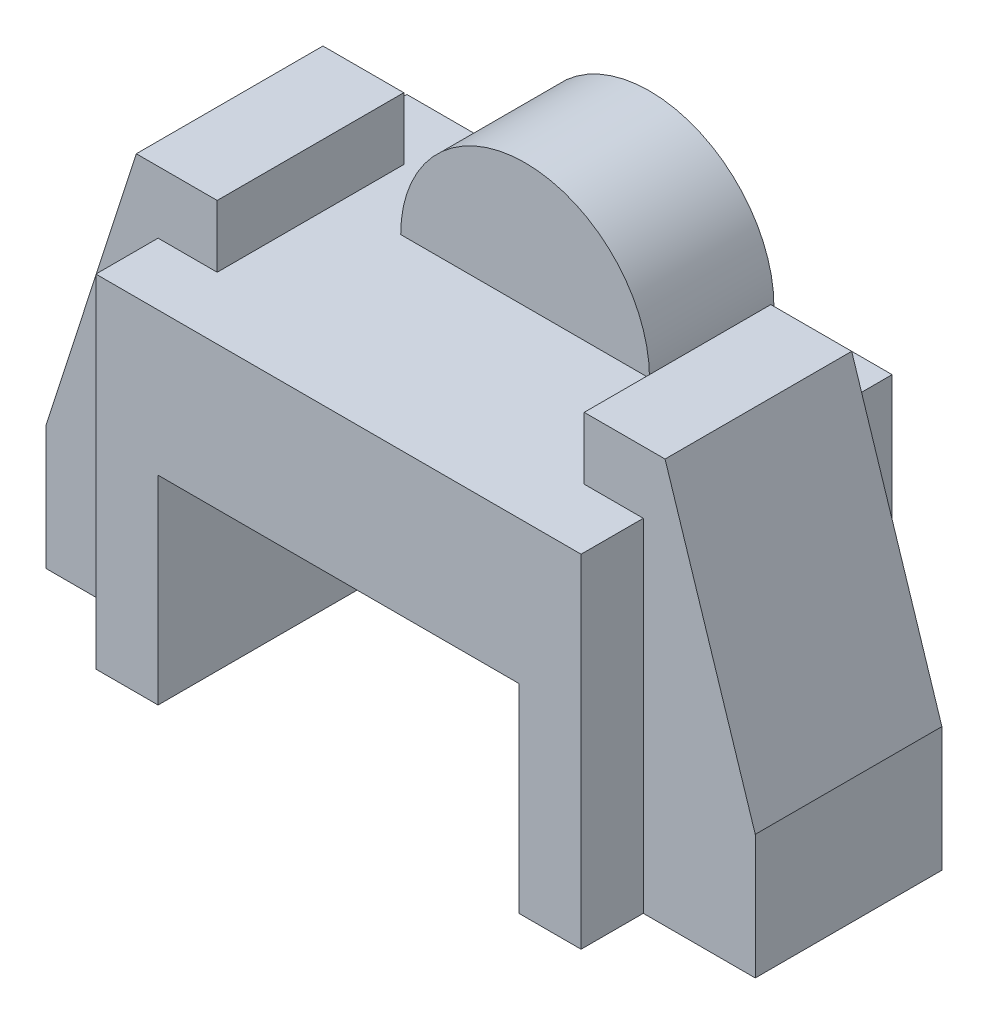
ISO-10303-21;
HEADER;
FILE_DESCRIPTION(('STEP AP214'),'2;1');
FILE_NAME('part.step','',(''),(''),'','','');
FILE_SCHEMA(('AUTOMOTIVE_DESIGN { 1 0 10303 214 1 1 1 1 }'));
ENDSEC;
DATA;
#1=APPLICATION_CONTEXT('core data for automotive mechanical design processes');
#2=APPLICATION_PROTOCOL_DEFINITION('international standard','automotive_design',2000,#1);
#3=PRODUCT_CONTEXT('',#1,'mechanical');
#4=PRODUCT('Part','Part','',(#3));
#5=PRODUCT_RELATED_PRODUCT_CATEGORY('part','',(#4));
#6=PRODUCT_DEFINITION_FORMATION('','',#4);
#7=PRODUCT_DEFINITION_CONTEXT('part definition',#1,'design');
#8=PRODUCT_DEFINITION('design','',#6,#7);
#9=PRODUCT_DEFINITION_SHAPE('','',#8);
#10=(LENGTH_UNIT() NAMED_UNIT(*) SI_UNIT(.MILLI.,.METRE.));
#11=(NAMED_UNIT(*) PLANE_ANGLE_UNIT() SI_UNIT($,.RADIAN.));
#12=(NAMED_UNIT(*) SI_UNIT($,.STERADIAN.) SOLID_ANGLE_UNIT());
#13=UNCERTAINTY_MEASURE_WITH_UNIT(LENGTH_MEASURE(1.E-05),#10,'distance_accuracy_value','');
#14=(GEOMETRIC_REPRESENTATION_CONTEXT(3) GLOBAL_UNCERTAINTY_ASSIGNED_CONTEXT((#13)) GLOBAL_UNIT_ASSIGNED_CONTEXT((#10,
#11,#12)) REPRESENTATION_CONTEXT('',''));
#15=CARTESIAN_POINT('',(0.,0.,0.));
#16=DIRECTION('',(0.,0.,1.));
#17=DIRECTION('',(1.,0.,0.));
#18=AXIS2_PLACEMENT_3D('',#15,#16,#17);
#19=CARTESIAN_POINT('',(0.,55.,50.));
#20=DIRECTION('',(0.,-1.,0.));
#21=DIRECTION('',(0.,0.,-1.));
#22=AXIS2_PLACEMENT_3D('',#19,#20,#21);
#23=PLANE('',#22);
#24=DIRECTION('',(-1.,0.,0.));
#25=VECTOR('',#24,1.);
#26=CARTESIAN_POINT('',(0.,55.,10.));
#27=LINE('',#26,#25);
#28=CARTESIAN_POINT('',(78.,55.,10.));
#29=VERTEX_POINT('',#28);
#30=CARTESIAN_POINT('',(68.5,55.,10.));
#31=VERTEX_POINT('',#30);
#32=EDGE_CURVE('E214',#29,#31,#27,.T.);
#33=ORIENTED_EDGE('',*,*,#32,.F.);
#34=DIRECTION('',(0.,0.,-1.));
#35=VECTOR('',#34,1.);
#36=CARTESIAN_POINT('',(78.,55.,50.));
#37=LINE('',#36,#35);
#38=CARTESIAN_POINT('',(78.,55.,0.));
#39=VERTEX_POINT('',#38);
#40=EDGE_CURVE('E349',#29,#39,#37,.T.);
#41=ORIENTED_EDGE('',*,*,#40,.T.);
#42=DIRECTION('',(-1.,0.,0.));
#43=VECTOR('',#42,1.);
#44=CARTESIAN_POINT('',(0.,55.,0.));
#45=LINE('',#44,#43);
#46=CARTESIAN_POINT('',(59.,55.,0.));
#47=VERTEX_POINT('',#46);
#48=EDGE_CURVE('E326',#39,#47,#45,.T.);
#49=ORIENTED_EDGE('',*,*,#48,.T.);
#50=DIRECTION('',(0.,0.,-1.));
#51=VECTOR('',#50,1.);
#52=CARTESIAN_POINT('',(59.,55.,20.));
#53=LINE('',#52,#51);
#54=CARTESIAN_POINT('',(59.,55.,20.));
#55=VERTEX_POINT('',#54);
#56=EDGE_CURVE('E288',#47,#55,#53,.F.);
#57=ORIENTED_EDGE('',*,*,#56,.T.);
#58=DIRECTION('',(1.,0.,0.));
#59=VECTOR('',#58,1.);
#60=CARTESIAN_POINT('',(0.,55.,20.));
#61=LINE('',#60,#59);
#62=CARTESIAN_POINT('',(19.,55.,20.));
#63=VERTEX_POINT('',#62);
#64=EDGE_CURVE('E361',#63,#55,#61,.T.);
#65=ORIENTED_EDGE('',*,*,#64,.F.);
#66=DIRECTION('',(0.,0.,-1.));
#67=VECTOR('',#66,1.);
#68=CARTESIAN_POINT('',(19.,55.,20.));
#69=LINE('',#68,#67);
#70=CARTESIAN_POINT('',(19.,55.,0.));
#71=VERTEX_POINT('',#70);
#72=EDGE_CURVE('E292',#63,#71,#69,.T.);
#73=ORIENTED_EDGE('',*,*,#72,.T.);
#74=CARTESIAN_POINT('',(0.,55.,0.));
#75=VERTEX_POINT('',#74);
#76=EDGE_CURVE('E344',#71,#75,#45,.T.);
#77=ORIENTED_EDGE('',*,*,#76,.T.);
#78=DIRECTION('',(0.,0.,-1.));
#79=VECTOR('',#78,1.);
#80=CARTESIAN_POINT('',(0.,55.,50.));
#81=LINE('',#80,#79);
#82=CARTESIAN_POINT('',(0.,55.,10.));
#83=VERTEX_POINT('',#82);
#84=EDGE_CURVE('E334',#83,#75,#81,.T.);
#85=ORIENTED_EDGE('',*,*,#84,.F.);
#86=DIRECTION('',(-1.,0.,0.));
#87=VECTOR('',#86,1.);
#88=CARTESIAN_POINT('',(0.,55.,10.));
#89=LINE('',#88,#87);
#90=CARTESIAN_POINT('',(9.49999999999997,55.,10.));
#91=VERTEX_POINT('',#90);
#92=EDGE_CURVE('E368',#91,#83,#89,.T.);
#93=ORIENTED_EDGE('',*,*,#92,.F.);
#94=DIRECTION('',(0.,0.,-1.));
#95=VECTOR('',#94,1.);
#96=CARTESIAN_POINT('',(9.49999999999997,55.,50.));
#97=LINE('',#96,#95);
#98=CARTESIAN_POINT('',(9.49999999999997,55.,40.));
#99=VERTEX_POINT('',#98);
#100=EDGE_CURVE('E366',#99,#91,#97,.T.);
#101=ORIENTED_EDGE('',*,*,#100,.F.);
#102=DIRECTION('',(-1.,0.,0.));
#103=VECTOR('',#102,1.);
#104=CARTESIAN_POINT('',(0.,55.,40.));
#105=LINE('',#104,#103);
#106=CARTESIAN_POINT('',(0.,55.,40.));
#107=VERTEX_POINT('',#106);
#108=EDGE_CURVE('E364',#99,#107,#105,.T.);
#109=ORIENTED_EDGE('',*,*,#108,.T.);
#110=CARTESIAN_POINT('',(0.,55.,50.));
#111=VERTEX_POINT('',#110);
#112=EDGE_CURVE('E346',#111,#107,#81,.T.);
#113=ORIENTED_EDGE('',*,*,#112,.F.);
#114=DIRECTION('',(-1.,0.,0.));
#115=VECTOR('',#114,1.);
#116=CARTESIAN_POINT('',(0.,55.,50.));
#117=LINE('',#116,#115);
#118=CARTESIAN_POINT('',(78.,55.,50.));
#119=VERTEX_POINT('',#118);
#120=EDGE_CURVE('E332',#119,#111,#117,.T.);
#121=ORIENTED_EDGE('',*,*,#120,.F.);
#122=CARTESIAN_POINT('',(78.,55.,40.));
#123=VERTEX_POINT('',#122);
#124=EDGE_CURVE('E350',#119,#123,#37,.T.);
#125=ORIENTED_EDGE('',*,*,#124,.T.);
#126=DIRECTION('',(-1.,0.,0.));
#127=VECTOR('',#126,1.);
#128=CARTESIAN_POINT('',(0.,55.,40.));
#129=LINE('',#128,#127);
#130=CARTESIAN_POINT('',(68.5,55.,40.));
#131=VERTEX_POINT('',#130);
#132=EDGE_CURVE('E49',#123,#131,#129,.T.);
#133=ORIENTED_EDGE('',*,*,#132,.T.);
#134=DIRECTION('',(0.,0.,-1.));
#135=VECTOR('',#134,1.);
#136=CARTESIAN_POINT('',(68.5,55.,50.));
#137=LINE('',#136,#135);
#138=EDGE_CURVE('E245',#131,#31,#137,.T.);
#139=ORIENTED_EDGE('',*,*,#138,.T.);
#140=EDGE_LOOP('',(#33,#41,#49,#57,#65,#73,#77,#85,#93,#101,#109,#113,#121,#125,#133,#139));
#141=FACE_BOUND('',#140,.T.);
#142=ADVANCED_FACE('F34',(#141),#23,.F.);
#143=CARTESIAN_POINT('',(78.,0.,50.));
#144=DIRECTION('',(-1.,0.,0.));
#145=DIRECTION('',(0.,0.,1.));
#146=AXIS2_PLACEMENT_3D('',#143,#144,#145);
#147=PLANE('',#146);
#148=DIRECTION('',(0.,1.,0.));
#149=VECTOR('',#148,1.);
#150=CARTESIAN_POINT('',(78.,0.,10.));
#151=LINE('',#150,#149);
#152=CARTESIAN_POINT('',(78.,0.,10.));
#153=VERTEX_POINT('',#152);
#154=EDGE_CURVE('E11',#153,#29,#151,.T.);
#155=ORIENTED_EDGE('',*,*,#154,.F.);
#156=DIRECTION('',(0.,0.,-1.));
#157=VECTOR('',#156,1.);
#158=CARTESIAN_POINT('',(78.,0.,50.));
#159=LINE('',#158,#157);
#160=CARTESIAN_POINT('',(78.,0.,0.));
#161=VERTEX_POINT('',#160);
#162=EDGE_CURVE('E353',#153,#161,#159,.T.);
#163=ORIENTED_EDGE('',*,*,#162,.T.);
#164=DIRECTION('',(0.,1.,0.));
#165=VECTOR('',#164,1.);
#166=CARTESIAN_POINT('',(78.,0.,0.));
#167=LINE('',#166,#165);
#168=EDGE_CURVE('E341',#161,#39,#167,.T.);
#169=ORIENTED_EDGE('',*,*,#168,.T.);
#170=ORIENTED_EDGE('',*,*,#40,.F.);
#171=EDGE_LOOP('',(#155,#163,#169,#170));
#172=FACE_BOUND('',#171,.T.);
#173=ADVANCED_FACE('F401',(#172),#147,.F.);
#174=CARTESIAN_POINT('',(0.,0.,50.));
#175=DIRECTION('',(1.,0.,0.));
#176=DIRECTION('',(0.,0.,-1.));
#177=AXIS2_PLACEMENT_3D('',#174,#175,#176);
#178=PLANE('',#177);
#179=DIRECTION('',(0.,-1.,0.));
#180=VECTOR('',#179,1.);
#181=CARTESIAN_POINT('',(0.,0.,10.));
#182=LINE('',#181,#180);
#183=CARTESIAN_POINT('',(0.,0.,10.));
#184=VERTEX_POINT('',#183);
#185=EDGE_CURVE('E282',#83,#184,#182,.T.);
#186=ORIENTED_EDGE('',*,*,#185,.F.);
#187=ORIENTED_EDGE('',*,*,#84,.T.);
#188=DIRECTION('',(0.,-1.,0.));
#189=VECTOR('',#188,1.);
#190=CARTESIAN_POINT('',(0.,0.,0.));
#191=LINE('',#190,#189);
#192=CARTESIAN_POINT('',(0.,0.,0.));
#193=VERTEX_POINT('',#192);
#194=EDGE_CURVE('E315',#75,#193,#191,.T.);
#195=ORIENTED_EDGE('',*,*,#194,.T.);
#196=DIRECTION('',(0.,0.,-1.));
#197=VECTOR('',#196,1.);
#198=CARTESIAN_POINT('',(0.,0.,50.));
#199=LINE('',#198,#197);
#200=EDGE_CURVE('E357',#184,#193,#199,.T.);
#201=ORIENTED_EDGE('',*,*,#200,.F.);
#202=EDGE_LOOP('',(#186,#187,#195,#201));
#203=FACE_BOUND('',#202,.T.);
#204=ADVANCED_FACE('F424',(#203),#178,.F.);
#205=CARTESIAN_POINT('',(0.,0.,50.));
#206=DIRECTION('',(0.,1.,0.));
#207=DIRECTION('',(0.,0.,1.));
#208=AXIS2_PLACEMENT_3D('',#205,#206,#207);
#209=PLANE('',#208);
#210=DIRECTION('',(-1.,0.,0.));
#211=VECTOR('',#210,1.);
#212=CARTESIAN_POINT('',(9.49999999999997,0.,10.));
#213=LINE('',#212,#211);
#214=CARTESIAN_POINT('',(-18.,0.,10.));
#215=VERTEX_POINT('',#214);
#216=EDGE_CURVE('E251',#184,#215,#213,.T.);
#217=ORIENTED_EDGE('',*,*,#216,.F.);
#218=ORIENTED_EDGE('',*,*,#200,.T.);
#219=DIRECTION('',(1.,0.,0.));
#220=VECTOR('',#219,1.);
#221=CARTESIAN_POINT('',(0.,0.,0.));
#222=LINE('',#221,#220);
#223=CARTESIAN_POINT('',(10.,0.,0.));
#224=VERTEX_POINT('',#223);
#225=EDGE_CURVE('E338',#193,#224,#222,.T.);
#226=ORIENTED_EDGE('',*,*,#225,.T.);
#227=DIRECTION('',(0.,0.,1.));
#228=VECTOR('',#227,1.);
#229=CARTESIAN_POINT('',(10.,0.,0.));
#230=LINE('',#229,#228);
#231=CARTESIAN_POINT('',(10.,0.,50.));
#232=VERTEX_POINT('',#231);
#233=EDGE_CURVE('E306',#224,#232,#230,.T.);
#234=ORIENTED_EDGE('',*,*,#233,.T.);
#235=DIRECTION('',(1.,0.,0.));
#236=VECTOR('',#235,1.);
#237=CARTESIAN_POINT('',(0.,0.,50.));
#238=LINE('',#237,#236);
#239=CARTESIAN_POINT('',(0.,0.,50.));
#240=VERTEX_POINT('',#239);
#241=EDGE_CURVE('E327',#240,#232,#238,.T.);
#242=ORIENTED_EDGE('',*,*,#241,.F.);
#243=CARTESIAN_POINT('',(0.,0.,40.));
#244=VERTEX_POINT('',#243);
#245=EDGE_CURVE('E358',#240,#244,#199,.T.);
#246=ORIENTED_EDGE('',*,*,#245,.T.);
#247=DIRECTION('',(-1.,0.,0.));
#248=VECTOR('',#247,1.);
#249=CARTESIAN_POINT('',(9.49999999999997,0.,40.));
#250=LINE('',#249,#248);
#251=CARTESIAN_POINT('',(-18.,0.,40.));
#252=VERTEX_POINT('',#251);
#253=EDGE_CURVE('E263',#244,#252,#250,.T.);
#254=ORIENTED_EDGE('',*,*,#253,.T.);
#255=DIRECTION('',(0.,0.,1.));
#256=VECTOR('',#255,1.);
#257=CARTESIAN_POINT('',(-18.,0.,10.));
#258=LINE('',#257,#256);
#259=EDGE_CURVE('E278',#215,#252,#258,.T.);
#260=ORIENTED_EDGE('',*,*,#259,.F.);
#261=EDGE_LOOP('',(#217,#218,#226,#234,#242,#246,#254,#260));
#262=FACE_BOUND('',#261,.T.);
#263=ADVANCED_FACE('F430',(#262),#209,.F.);
#264=ORIENTED_EDGE('',*,*,#112,.T.);
#265=DIRECTION('',(0.,-1.,0.));
#266=VECTOR('',#265,1.);
#267=CARTESIAN_POINT('',(0.,0.,40.));
#268=LINE('',#267,#266);
#269=EDGE_CURVE('E57',#107,#244,#268,.T.);
#270=ORIENTED_EDGE('',*,*,#269,.T.);
#271=ORIENTED_EDGE('',*,*,#245,.F.);
#272=DIRECTION('',(0.,-1.,0.));
#273=VECTOR('',#272,1.);
#274=CARTESIAN_POINT('',(0.,0.,50.));
#275=LINE('',#274,#273);
#276=EDGE_CURVE('E322',#111,#240,#275,.T.);
#277=ORIENTED_EDGE('',*,*,#276,.F.);
#278=EDGE_LOOP('',(#264,#270,#271,#277));
#279=FACE_BOUND('',#278,.T.);
#280=ADVANCED_FACE('F36',(#279),#178,.F.);
#281=ORIENTED_EDGE('',*,*,#162,.F.);
#282=DIRECTION('',(1.,0.,0.));
#283=VECTOR('',#282,1.);
#284=CARTESIAN_POINT('',(68.5,0.,10.));
#285=LINE('',#284,#283);
#286=CARTESIAN_POINT('',(96.,0.,10.));
#287=VERTEX_POINT('',#286);
#288=EDGE_CURVE('E225',#153,#287,#285,.T.);
#289=ORIENTED_EDGE('',*,*,#288,.T.);
#290=DIRECTION('',(0.,0.,1.));
#291=VECTOR('',#290,1.);
#292=CARTESIAN_POINT('',(96.,0.,10.));
#293=LINE('',#292,#291);
#294=CARTESIAN_POINT('',(96.,0.,40.));
#295=VERTEX_POINT('',#294);
#296=EDGE_CURVE('E227',#287,#295,#293,.T.);
#297=ORIENTED_EDGE('',*,*,#296,.T.);
#298=DIRECTION('',(1.,0.,0.));
#299=VECTOR('',#298,1.);
#300=CARTESIAN_POINT('',(68.5,0.,40.));
#301=LINE('',#300,#299);
#302=CARTESIAN_POINT('',(78.,0.,40.));
#303=VERTEX_POINT('',#302);
#304=EDGE_CURVE('E215',#303,#295,#301,.T.);
#305=ORIENTED_EDGE('',*,*,#304,.F.);
#306=CARTESIAN_POINT('',(78.,0.,50.));
#307=VERTEX_POINT('',#306);
#308=EDGE_CURVE('E354',#307,#303,#159,.T.);
#309=ORIENTED_EDGE('',*,*,#308,.F.);
#310=CARTESIAN_POINT('',(68.,0.,50.));
#311=VERTEX_POINT('',#310);
#312=EDGE_CURVE('E325',#311,#307,#238,.T.);
#313=ORIENTED_EDGE('',*,*,#312,.F.);
#314=DIRECTION('',(0.,0.,1.));
#315=VECTOR('',#314,1.);
#316=CARTESIAN_POINT('',(68.,0.,0.));
#317=LINE('',#316,#315);
#318=CARTESIAN_POINT('',(68.,0.,0.));
#319=VERTEX_POINT('',#318);
#320=EDGE_CURVE('E318',#319,#311,#317,.T.);
#321=ORIENTED_EDGE('',*,*,#320,.F.);
#322=EDGE_CURVE('E337',#319,#161,#222,.T.);
#323=ORIENTED_EDGE('',*,*,#322,.T.);
#324=EDGE_LOOP('',(#281,#289,#297,#305,#309,#313,#321,#323));
#325=FACE_BOUND('',#324,.T.);
#326=ADVANCED_FACE('F388',(#325),#209,.F.);
#327=ORIENTED_EDGE('',*,*,#308,.T.);
#328=DIRECTION('',(0.,1.,0.));
#329=VECTOR('',#328,1.);
#330=CARTESIAN_POINT('',(78.,0.,40.));
#331=LINE('',#330,#329);
#332=EDGE_CURVE('E42',#303,#123,#331,.T.);
#333=ORIENTED_EDGE('',*,*,#332,.T.);
#334=ORIENTED_EDGE('',*,*,#124,.F.);
#335=DIRECTION('',(0.,1.,0.));
#336=VECTOR('',#335,1.);
#337=CARTESIAN_POINT('',(78.,0.,50.));
#338=LINE('',#337,#336);
#339=EDGE_CURVE('E330',#307,#119,#338,.T.);
#340=ORIENTED_EDGE('',*,*,#339,.F.);
#341=EDGE_LOOP('',(#327,#333,#334,#340));
#342=FACE_BOUND('',#341,.T.);
#343=ADVANCED_FACE('F371',(#342),#147,.F.);
#344=CARTESIAN_POINT('',(0.,0.,50.));
#345=DIRECTION('',(0.,0.,-1.));
#346=DIRECTION('',(-1.,0.,0.));
#347=AXIS2_PLACEMENT_3D('',#344,#345,#346);
#348=PLANE('',#347);
#349=ORIENTED_EDGE('',*,*,#241,.T.);
#350=DIRECTION('',(0.,-1.,0.));
#351=VECTOR('',#350,1.);
#352=CARTESIAN_POINT('',(10.,0.,50.));
#353=LINE('',#352,#351);
#354=CARTESIAN_POINT('',(10.,32.,50.));
#355=VERTEX_POINT('',#354);
#356=EDGE_CURVE('E295',#355,#232,#353,.T.);
#357=ORIENTED_EDGE('',*,*,#356,.F.);
#358=DIRECTION('',(-1.,0.,0.));
#359=VECTOR('',#358,1.);
#360=CARTESIAN_POINT('',(10.,32.,50.));
#361=LINE('',#360,#359);
#362=CARTESIAN_POINT('',(68.,32.,50.));
#363=VERTEX_POINT('',#362);
#364=EDGE_CURVE('E300',#363,#355,#361,.T.);
#365=ORIENTED_EDGE('',*,*,#364,.F.);
#366=DIRECTION('',(0.,1.,0.));
#367=VECTOR('',#366,1.);
#368=CARTESIAN_POINT('',(68.,0.,50.));
#369=LINE('',#368,#367);
#370=EDGE_CURVE('E308',#311,#363,#369,.T.);
#371=ORIENTED_EDGE('',*,*,#370,.F.);
#372=ORIENTED_EDGE('',*,*,#312,.T.);
#373=ORIENTED_EDGE('',*,*,#339,.T.);
#374=ORIENTED_EDGE('',*,*,#120,.T.);
#375=ORIENTED_EDGE('',*,*,#276,.T.);
#376=EDGE_LOOP('',(#349,#357,#365,#371,#372,#373,#374,#375));
#377=FACE_BOUND('',#376,.T.);
#378=ADVANCED_FACE('F380',(#377),#348,.F.);
#379=CARTESIAN_POINT('',(0.,0.,0.));
#380=DIRECTION('',(0.,0.,-1.));
#381=DIRECTION('',(-1.,0.,0.));
#382=AXIS2_PLACEMENT_3D('',#379,#380,#381);
#383=PLANE('',#382);
#384=ORIENTED_EDGE('',*,*,#76,.F.);
#385=CARTESIAN_POINT('',(39.,55.,0.));
#386=DIRECTION('',(0.,0.,-1.));
#387=DIRECTION('',(-1.,0.,0.));
#388=AXIS2_PLACEMENT_3D('',#385,#386,#387);
#389=CIRCLE('',#388,20.);
#390=EDGE_CURVE('E284',#71,#47,#389,.T.);
#391=ORIENTED_EDGE('',*,*,#390,.T.);
#392=ORIENTED_EDGE('',*,*,#48,.F.);
#393=ORIENTED_EDGE('',*,*,#168,.F.);
#394=ORIENTED_EDGE('',*,*,#322,.F.);
#395=DIRECTION('',(0.,1.,0.));
#396=VECTOR('',#395,1.);
#397=CARTESIAN_POINT('',(68.,0.,0.));
#398=LINE('',#397,#396);
#399=CARTESIAN_POINT('',(68.,32.,0.));
#400=VERTEX_POINT('',#399);
#401=EDGE_CURVE('E299',#319,#400,#398,.T.);
#402=ORIENTED_EDGE('',*,*,#401,.T.);
#403=DIRECTION('',(-1.,0.,0.));
#404=VECTOR('',#403,1.);
#405=CARTESIAN_POINT('',(10.,32.,0.));
#406=LINE('',#405,#404);
#407=CARTESIAN_POINT('',(10.,32.,0.));
#408=VERTEX_POINT('',#407);
#409=EDGE_CURVE('E303',#400,#408,#406,.T.);
#410=ORIENTED_EDGE('',*,*,#409,.T.);
#411=DIRECTION('',(0.,-1.,0.));
#412=VECTOR('',#411,1.);
#413=CARTESIAN_POINT('',(10.,0.,0.));
#414=LINE('',#413,#412);
#415=EDGE_CURVE('E296',#408,#224,#414,.T.);
#416=ORIENTED_EDGE('',*,*,#415,.T.);
#417=ORIENTED_EDGE('',*,*,#225,.F.);
#418=ORIENTED_EDGE('',*,*,#194,.F.);
#419=EDGE_LOOP('',(#384,#391,#392,#393,#394,#402,#410,#416,#417,#418));
#420=FACE_BOUND('',#419,.T.);
#421=ADVANCED_FACE('F407',(#420),#383,.T.);
#422=CARTESIAN_POINT('',(10.,0.,0.));
#423=DIRECTION('',(-1.,0.,0.));
#424=DIRECTION('',(0.,0.,1.));
#425=AXIS2_PLACEMENT_3D('',#422,#423,#424);
#426=PLANE('',#425);
#427=ORIENTED_EDGE('',*,*,#356,.T.);
#428=ORIENTED_EDGE('',*,*,#233,.F.);
#429=ORIENTED_EDGE('',*,*,#415,.F.);
#430=DIRECTION('',(0.,0.,1.));
#431=VECTOR('',#430,1.);
#432=CARTESIAN_POINT('',(10.,32.,0.));
#433=LINE('',#432,#431);
#434=EDGE_CURVE('E313',#408,#355,#433,.T.);
#435=ORIENTED_EDGE('',*,*,#434,.T.);
#436=EDGE_LOOP('',(#427,#428,#429,#435));
#437=FACE_BOUND('',#436,.T.);
#438=ADVANCED_FACE('F454',(#437),#426,.F.);
#439=CARTESIAN_POINT('',(10.,32.,0.));
#440=DIRECTION('',(0.,1.,0.));
#441=DIRECTION('',(0.,0.,1.));
#442=AXIS2_PLACEMENT_3D('',#439,#440,#441);
#443=PLANE('',#442);
#444=ORIENTED_EDGE('',*,*,#364,.T.);
#445=ORIENTED_EDGE('',*,*,#434,.F.);
#446=ORIENTED_EDGE('',*,*,#409,.F.);
#447=DIRECTION('',(0.,0.,1.));
#448=VECTOR('',#447,1.);
#449=CARTESIAN_POINT('',(68.,32.,0.));
#450=LINE('',#449,#448);
#451=EDGE_CURVE('E316',#400,#363,#450,.T.);
#452=ORIENTED_EDGE('',*,*,#451,.T.);
#453=EDGE_LOOP('',(#444,#445,#446,#452));
#454=FACE_BOUND('',#453,.T.);
#455=ADVANCED_FACE('F457',(#454),#443,.F.);
#456=CARTESIAN_POINT('',(68.,0.,0.));
#457=DIRECTION('',(1.,0.,0.));
#458=DIRECTION('',(0.,0.,-1.));
#459=AXIS2_PLACEMENT_3D('',#456,#457,#458);
#460=PLANE('',#459);
#461=ORIENTED_EDGE('',*,*,#370,.T.);
#462=ORIENTED_EDGE('',*,*,#451,.F.);
#463=ORIENTED_EDGE('',*,*,#401,.F.);
#464=ORIENTED_EDGE('',*,*,#320,.T.);
#465=EDGE_LOOP('',(#461,#462,#463,#464));
#466=FACE_BOUND('',#465,.T.);
#467=ADVANCED_FACE('F460',(#466),#460,.F.);
#468=CARTESIAN_POINT('',(39.,55.,20.));
#469=DIRECTION('',(0.,0.,-1.));
#470=DIRECTION('',(-1.,0.,0.));
#471=AXIS2_PLACEMENT_3D('',#468,#469,#470);
#472=PLANE('',#471);
#473=CARTESIAN_POINT('',(39.,55.,20.));
#474=DIRECTION('',(0.,0.,-1.));
#475=DIRECTION('',(-1.,0.,0.));
#476=AXIS2_PLACEMENT_3D('',#473,#474,#475);
#477=CIRCLE('',#476,20.);
#478=EDGE_CURVE('E285',#63,#55,#477,.T.);
#479=ORIENTED_EDGE('',*,*,#478,.F.);
#480=ORIENTED_EDGE('',*,*,#64,.T.);
#481=EDGE_LOOP('',(#479,#480));
#482=FACE_BOUND('',#481,.T.);
#483=ADVANCED_FACE('F415',(#482),#472,.F.);
#484=CARTESIAN_POINT('',(39.,55.,20.));
#485=DIRECTION('',(0.,0.,-1.));
#486=DIRECTION('',(-1.,0.,0.));
#487=AXIS2_PLACEMENT_3D('',#484,#485,#486);
#488=CYLINDRICAL_SURFACE('',#487,20.);
#489=ORIENTED_EDGE('',*,*,#72,.F.);
#490=ORIENTED_EDGE('',*,*,#478,.T.);
#491=ORIENTED_EDGE('',*,*,#56,.F.);
#492=ORIENTED_EDGE('',*,*,#390,.F.);
#493=EDGE_LOOP('',(#489,#490,#491,#492));
#494=FACE_BOUND('',#493,.T.);
#495=ADVANCED_FACE('F412',(#494),#488,.T.);
#496=CARTESIAN_POINT('',(9.49999999999997,0.,10.));
#497=DIRECTION('',(-1.,0.,0.));
#498=DIRECTION('',(0.,0.,1.));
#499=AXIS2_PLACEMENT_3D('',#496,#497,#498);
#500=PLANE('',#499);
#501=DIRECTION('',(0.,-1.,0.));
#502=VECTOR('',#501,1.);
#503=CARTESIAN_POINT('',(9.49999999999997,0.,40.));
#504=LINE('',#503,#502);
#505=CARTESIAN_POINT('',(9.49999999999997,65.,40.));
#506=VERTEX_POINT('',#505);
#507=EDGE_CURVE('E247',#506,#99,#504,.T.);
#508=ORIENTED_EDGE('',*,*,#507,.T.);
#509=ORIENTED_EDGE('',*,*,#100,.T.);
#510=DIRECTION('',(0.,-1.,0.));
#511=VECTOR('',#510,1.);
#512=CARTESIAN_POINT('',(9.49999999999997,0.,10.));
#513=LINE('',#512,#511);
#514=CARTESIAN_POINT('',(9.49999999999997,65.,10.));
#515=VERTEX_POINT('',#514);
#516=EDGE_CURVE('E248',#515,#91,#513,.T.);
#517=ORIENTED_EDGE('',*,*,#516,.F.);
#518=DIRECTION('',(0.,0.,1.));
#519=VECTOR('',#518,1.);
#520=CARTESIAN_POINT('',(9.49999999999997,65.,10.));
#521=LINE('',#520,#519);
#522=EDGE_CURVE('E260',#515,#506,#521,.T.);
#523=ORIENTED_EDGE('',*,*,#522,.T.);
#524=EDGE_LOOP('',(#508,#509,#517,#523));
#525=FACE_BOUND('',#524,.T.);
#526=ADVANCED_FACE('F449',(#525),#500,.F.);
#527=CARTESIAN_POINT('',(0.,0.,10.));
#528=DIRECTION('',(0.,0.,1.));
#529=DIRECTION('',(1.,0.,0.));
#530=AXIS2_PLACEMENT_3D('',#527,#528,#529);
#531=PLANE('',#530);
#532=ORIENTED_EDGE('',*,*,#92,.T.);
#533=ORIENTED_EDGE('',*,*,#185,.T.);
#534=ORIENTED_EDGE('',*,*,#216,.T.);
#535=DIRECTION('',(0.,1.,0.));
#536=VECTOR('',#535,1.);
#537=CARTESIAN_POINT('',(-18.,20.,10.));
#538=LINE('',#537,#536);
#539=CARTESIAN_POINT('',(-18.,20.,10.));
#540=VERTEX_POINT('',#539);
#541=EDGE_CURVE('E254',#215,#540,#538,.T.);
#542=ORIENTED_EDGE('',*,*,#541,.T.);
#543=DIRECTION('',(0.306693767453372,0.951808243820811,0.));
#544=VECTOR('',#543,1.);
#545=CARTESIAN_POINT('',(-3.50000000000003,65.,10.));
#546=LINE('',#545,#544);
#547=CARTESIAN_POINT('',(-3.50000000000003,65.,10.));
#548=VERTEX_POINT('',#547);
#549=EDGE_CURVE('E256',#540,#548,#546,.T.);
#550=ORIENTED_EDGE('',*,*,#549,.T.);
#551=DIRECTION('',(1.,0.,0.));
#552=VECTOR('',#551,1.);
#553=CARTESIAN_POINT('',(9.49999999999997,65.,10.));
#554=LINE('',#553,#552);
#555=EDGE_CURVE('E258',#548,#515,#554,.T.);
#556=ORIENTED_EDGE('',*,*,#555,.T.);
#557=ORIENTED_EDGE('',*,*,#516,.T.);
#558=EDGE_LOOP('',(#532,#533,#534,#542,#550,#556,#557));
#559=FACE_BOUND('',#558,.T.);
#560=ADVANCED_FACE('F427',(#559),#531,.F.);
#561=CARTESIAN_POINT('',(0.,0.,40.));
#562=DIRECTION('',(0.,0.,1.));
#563=DIRECTION('',(1.,0.,0.));
#564=AXIS2_PLACEMENT_3D('',#561,#562,#563);
#565=PLANE('',#564);
#566=ORIENTED_EDGE('',*,*,#269,.F.);
#567=ORIENTED_EDGE('',*,*,#108,.F.);
#568=ORIENTED_EDGE('',*,*,#507,.F.);
#569=DIRECTION('',(1.,0.,0.));
#570=VECTOR('',#569,1.);
#571=CARTESIAN_POINT('',(9.49999999999997,65.,40.));
#572=LINE('',#571,#570);
#573=CARTESIAN_POINT('',(-3.50000000000003,65.,40.));
#574=VERTEX_POINT('',#573);
#575=EDGE_CURVE('E252',#574,#506,#572,.T.);
#576=ORIENTED_EDGE('',*,*,#575,.F.);
#577=DIRECTION('',(0.306693767453372,0.951808243820811,0.));
#578=VECTOR('',#577,1.);
#579=CARTESIAN_POINT('',(-3.50000000000003,65.,40.));
#580=LINE('',#579,#578);
#581=CARTESIAN_POINT('',(-18.,20.,40.));
#582=VERTEX_POINT('',#581);
#583=EDGE_CURVE('E267',#582,#574,#580,.T.);
#584=ORIENTED_EDGE('',*,*,#583,.F.);
#585=DIRECTION('',(0.,1.,0.));
#586=VECTOR('',#585,1.);
#587=CARTESIAN_POINT('',(-18.,20.,40.));
#588=LINE('',#587,#586);
#589=EDGE_CURVE('E265',#252,#582,#588,.T.);
#590=ORIENTED_EDGE('',*,*,#589,.F.);
#591=ORIENTED_EDGE('',*,*,#253,.F.);
#592=EDGE_LOOP('',(#566,#567,#568,#576,#584,#590,#591));
#593=FACE_BOUND('',#592,.T.);
#594=ADVANCED_FACE('F567',(#593),#565,.T.);
#595=CARTESIAN_POINT('',(-18.,20.,10.));
#596=DIRECTION('',(1.,0.,0.));
#597=DIRECTION('',(0.,1.,0.));
#598=AXIS2_PLACEMENT_3D('',#595,#596,#597);
#599=PLANE('',#598);
#600=ORIENTED_EDGE('',*,*,#589,.T.);
#601=DIRECTION('',(0.,0.,1.));
#602=VECTOR('',#601,1.);
#603=CARTESIAN_POINT('',(-18.,20.,10.));
#604=LINE('',#603,#602);
#605=EDGE_CURVE('E275',#540,#582,#604,.T.);
#606=ORIENTED_EDGE('',*,*,#605,.F.);
#607=ORIENTED_EDGE('',*,*,#541,.F.);
#608=ORIENTED_EDGE('',*,*,#259,.T.);
#609=EDGE_LOOP('',(#600,#606,#607,#608));
#610=FACE_BOUND('',#609,.T.);
#611=ADVANCED_FACE('F435',(#610),#599,.F.);
#612=CARTESIAN_POINT('',(-3.50000000000003,65.,10.));
#613=DIRECTION('',(0.951808243820811,-0.306693767453372,0.));
#614=DIRECTION('',(0.306693767453372,0.951808243820812,0.));
#615=AXIS2_PLACEMENT_3D('',#612,#613,#614);
#616=PLANE('',#615);
#617=ORIENTED_EDGE('',*,*,#583,.T.);
#618=DIRECTION('',(0.,0.,1.));
#619=VECTOR('',#618,1.);
#620=CARTESIAN_POINT('',(-3.50000000000003,65.,10.));
#621=LINE('',#620,#619);
#622=EDGE_CURVE('E272',#548,#574,#621,.T.);
#623=ORIENTED_EDGE('',*,*,#622,.F.);
#624=ORIENTED_EDGE('',*,*,#549,.F.);
#625=ORIENTED_EDGE('',*,*,#605,.T.);
#626=EDGE_LOOP('',(#617,#623,#624,#625));
#627=FACE_BOUND('',#626,.T.);
#628=ADVANCED_FACE('F441',(#627),#616,.F.);
#629=CARTESIAN_POINT('',(9.49999999999997,65.,10.));
#630=DIRECTION('',(0.,-1.,0.));
#631=DIRECTION('',(0.,0.,-1.));
#632=AXIS2_PLACEMENT_3D('',#629,#630,#631);
#633=PLANE('',#632);
#634=ORIENTED_EDGE('',*,*,#575,.T.);
#635=ORIENTED_EDGE('',*,*,#522,.F.);
#636=ORIENTED_EDGE('',*,*,#555,.F.);
#637=ORIENTED_EDGE('',*,*,#622,.T.);
#638=EDGE_LOOP('',(#634,#635,#636,#637));
#639=FACE_BOUND('',#638,.T.);
#640=ADVANCED_FACE('F445',(#639),#633,.F.);
#641=CARTESIAN_POINT('',(68.5,0.,10.));
#642=DIRECTION('',(-1.,0.,0.));
#643=DIRECTION('',(0.,-1.,0.));
#644=AXIS2_PLACEMENT_3D('',#641,#642,#643);
#645=PLANE('',#644);
#646=ORIENTED_EDGE('',*,*,#138,.F.);
#647=DIRECTION('',(0.,-1.,0.));
#648=VECTOR('',#647,1.);
#649=CARTESIAN_POINT('',(68.5,0.,40.));
#650=LINE('',#649,#648);
#651=CARTESIAN_POINT('',(68.5,65.,40.));
#652=VERTEX_POINT('',#651);
#653=EDGE_CURVE('E200',#652,#131,#650,.T.);
#654=ORIENTED_EDGE('',*,*,#653,.F.);
#655=DIRECTION('',(0.,0.,1.));
#656=VECTOR('',#655,1.);
#657=CARTESIAN_POINT('',(68.5,65.,10.));
#658=LINE('',#657,#656);
#659=CARTESIAN_POINT('',(68.5,65.,10.));
#660=VERTEX_POINT('',#659);
#661=EDGE_CURVE('E195',#660,#652,#658,.T.);
#662=ORIENTED_EDGE('',*,*,#661,.F.);
#663=DIRECTION('',(0.,-1.,0.));
#664=VECTOR('',#663,1.);
#665=CARTESIAN_POINT('',(68.5,0.,10.));
#666=LINE('',#665,#664);
#667=EDGE_CURVE('E198',#660,#31,#666,.T.);
#668=ORIENTED_EDGE('',*,*,#667,.T.);
#669=EDGE_LOOP('',(#646,#654,#662,#668));
#670=FACE_BOUND('',#669,.T.);
#671=ADVANCED_FACE('F197',(#670),#645,.T.);
#672=CARTESIAN_POINT('',(78.,0.,10.));
#673=DIRECTION('',(0.,0.,1.));
#674=DIRECTION('',(-1.,0.,0.));
#675=AXIS2_PLACEMENT_3D('',#672,#673,#674);
#676=PLANE('',#675);
#677=ORIENTED_EDGE('',*,*,#154,.T.);
#678=ORIENTED_EDGE('',*,*,#32,.T.);
#679=ORIENTED_EDGE('',*,*,#667,.F.);
#680=DIRECTION('',(-1.,0.,0.));
#681=VECTOR('',#680,1.);
#682=CARTESIAN_POINT('',(68.5,65.,10.));
#683=LINE('',#682,#681);
#684=CARTESIAN_POINT('',(81.5,65.,10.));
#685=VERTEX_POINT('',#684);
#686=EDGE_CURVE('E211',#685,#660,#683,.T.);
#687=ORIENTED_EDGE('',*,*,#686,.F.);
#688=DIRECTION('',(-0.306693767453371,0.951808243820812,0.));
#689=VECTOR('',#688,1.);
#690=CARTESIAN_POINT('',(81.5,65.,10.));
#691=LINE('',#690,#689);
#692=CARTESIAN_POINT('',(96.,20.,10.));
#693=VERTEX_POINT('',#692);
#694=EDGE_CURVE('E218',#693,#685,#691,.T.);
#695=ORIENTED_EDGE('',*,*,#694,.F.);
#696=DIRECTION('',(0.,1.,0.));
#697=VECTOR('',#696,1.);
#698=CARTESIAN_POINT('',(96.,20.,10.));
#699=LINE('',#698,#697);
#700=EDGE_CURVE('E220',#287,#693,#699,.T.);
#701=ORIENTED_EDGE('',*,*,#700,.F.);
#702=ORIENTED_EDGE('',*,*,#288,.F.);
#703=EDGE_LOOP('',(#677,#678,#679,#687,#695,#701,#702));
#704=FACE_BOUND('',#703,.T.);
#705=ADVANCED_FACE('F209',(#704),#676,.F.);
#706=CARTESIAN_POINT('',(78.,0.,40.));
#707=DIRECTION('',(0.,0.,1.));
#708=DIRECTION('',(-1.,0.,0.));
#709=AXIS2_PLACEMENT_3D('',#706,#707,#708);
#710=PLANE('',#709);
#711=ORIENTED_EDGE('',*,*,#132,.F.);
#712=ORIENTED_EDGE('',*,*,#332,.F.);
#713=ORIENTED_EDGE('',*,*,#304,.T.);
#714=DIRECTION('',(0.,1.,0.));
#715=VECTOR('',#714,1.);
#716=CARTESIAN_POINT('',(96.,20.,40.));
#717=LINE('',#716,#715);
#718=CARTESIAN_POINT('',(96.,20.,40.));
#719=VERTEX_POINT('',#718);
#720=EDGE_CURVE('E234',#295,#719,#717,.T.);
#721=ORIENTED_EDGE('',*,*,#720,.T.);
#722=DIRECTION('',(-0.306693767453371,0.951808243820812,0.));
#723=VECTOR('',#722,1.);
#724=CARTESIAN_POINT('',(81.5,65.,40.));
#725=LINE('',#724,#723);
#726=CARTESIAN_POINT('',(81.5,65.,40.));
#727=VERTEX_POINT('',#726);
#728=EDGE_CURVE('E231',#719,#727,#725,.T.);
#729=ORIENTED_EDGE('',*,*,#728,.T.);
#730=DIRECTION('',(-1.,0.,0.));
#731=VECTOR('',#730,1.);
#732=CARTESIAN_POINT('',(68.5,65.,40.));
#733=LINE('',#732,#731);
#734=EDGE_CURVE('E229',#727,#652,#733,.T.);
#735=ORIENTED_EDGE('',*,*,#734,.T.);
#736=ORIENTED_EDGE('',*,*,#653,.T.);
#737=EDGE_LOOP('',(#711,#712,#713,#721,#729,#735,#736));
#738=FACE_BOUND('',#737,.T.);
#739=ADVANCED_FACE('F391',(#738),#710,.T.);
#740=CARTESIAN_POINT('',(68.5,65.,10.));
#741=DIRECTION('',(0.,1.,0.));
#742=DIRECTION('',(-1.,0.,0.));
#743=AXIS2_PLACEMENT_3D('',#740,#741,#742);
#744=PLANE('',#743);
#745=ORIENTED_EDGE('',*,*,#734,.F.);
#746=DIRECTION('',(0.,0.,1.));
#747=VECTOR('',#746,1.);
#748=CARTESIAN_POINT('',(81.5,65.,10.));
#749=LINE('',#748,#747);
#750=EDGE_CURVE('E205',#685,#727,#749,.T.);
#751=ORIENTED_EDGE('',*,*,#750,.F.);
#752=ORIENTED_EDGE('',*,*,#686,.T.);
#753=ORIENTED_EDGE('',*,*,#661,.T.);
#754=EDGE_LOOP('',(#745,#751,#752,#753));
#755=FACE_BOUND('',#754,.T.);
#756=ADVANCED_FACE('F217',(#755),#744,.T.);
#757=CARTESIAN_POINT('',(81.5,65.,10.));
#758=DIRECTION('',(0.951808243820812,0.306693767453371,0.));
#759=DIRECTION('',(-0.306693767453371,0.951808243820812,0.));
#760=AXIS2_PLACEMENT_3D('',#757,#758,#759);
#761=PLANE('',#760);
#762=ORIENTED_EDGE('',*,*,#728,.F.);
#763=DIRECTION('',(0.,0.,1.));
#764=VECTOR('',#763,1.);
#765=CARTESIAN_POINT('',(96.,20.,10.));
#766=LINE('',#765,#764);
#767=EDGE_CURVE('E240',#693,#719,#766,.T.);
#768=ORIENTED_EDGE('',*,*,#767,.F.);
#769=ORIENTED_EDGE('',*,*,#694,.T.);
#770=ORIENTED_EDGE('',*,*,#750,.T.);
#771=EDGE_LOOP('',(#762,#768,#769,#770));
#772=FACE_BOUND('',#771,.T.);
#773=ADVANCED_FACE('F397',(#772),#761,.T.);
#774=CARTESIAN_POINT('',(96.,20.,10.));
#775=DIRECTION('',(1.,0.,0.));
#776=DIRECTION('',(0.,1.,0.));
#777=AXIS2_PLACEMENT_3D('',#774,#775,#776);
#778=PLANE('',#777);
#779=ORIENTED_EDGE('',*,*,#720,.F.);
#780=ORIENTED_EDGE('',*,*,#296,.F.);
#781=ORIENTED_EDGE('',*,*,#700,.T.);
#782=ORIENTED_EDGE('',*,*,#767,.T.);
#783=EDGE_LOOP('',(#779,#780,#781,#782));
#784=FACE_BOUND('',#783,.T.);
#785=ADVANCED_FACE('F394',(#784),#778,.T.);
#786=CLOSED_SHELL('',(#142,#173,#204,#263,#280,#326,#343,#378,#421,#438,#455,#467,#483,#495,
#526,#560,#594,#611,#628,#640,#671,#705,#739,#756,#773,#785));
#787=MANIFOLD_SOLID_BREP('B2',#786);
#788=ADVANCED_BREP_SHAPE_REPRESENTATION('',(#18,#787),#14);
#789=SHAPE_DEFINITION_REPRESENTATION(#9,#788);
ENDSEC;
END-ISO-10303-21;
